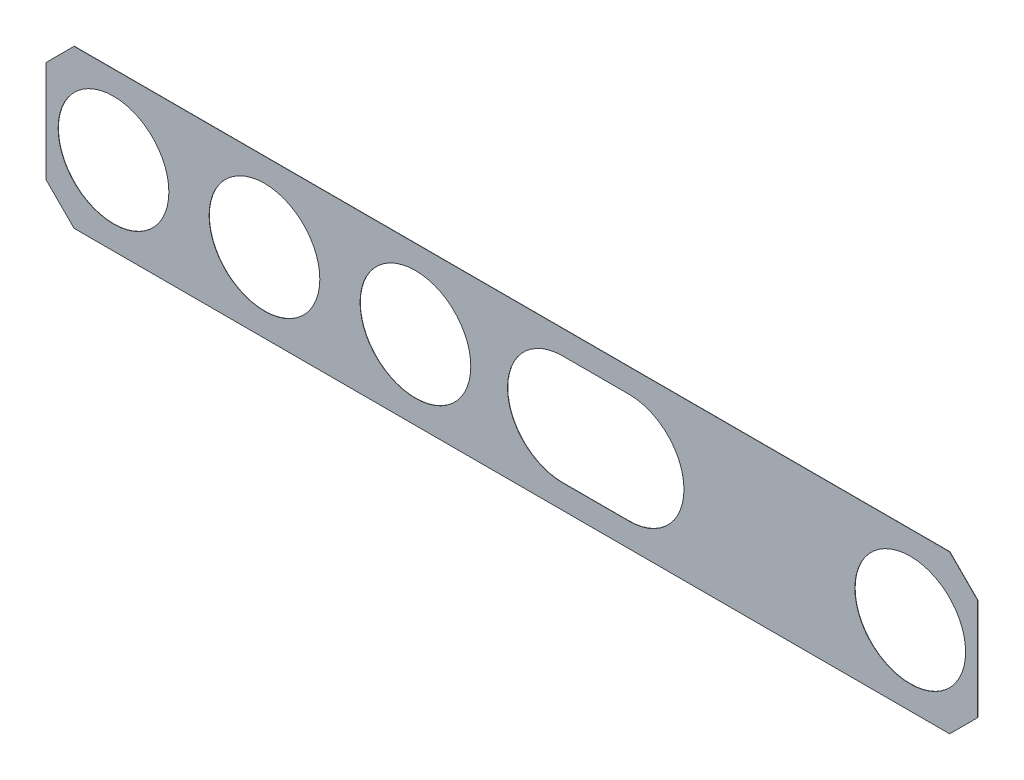
ISO-10303-21;
HEADER;
FILE_DESCRIPTION(('STEP AP214'),'2;1');
FILE_NAME('part.step','',(''),(''),'','','');
FILE_SCHEMA(('AUTOMOTIVE_DESIGN { 1 0 10303 214 1 1 1 1 }'));
ENDSEC;
DATA;
#1=APPLICATION_CONTEXT('core data for automotive mechanical design processes');
#2=APPLICATION_PROTOCOL_DEFINITION('international standard','automotive_design',2000,#1);
#3=PRODUCT_CONTEXT('',#1,'mechanical');
#4=PRODUCT('Part','Part','',(#3));
#5=PRODUCT_RELATED_PRODUCT_CATEGORY('part','',(#4));
#6=PRODUCT_DEFINITION_FORMATION('','',#4);
#7=PRODUCT_DEFINITION_CONTEXT('part definition',#1,'design');
#8=PRODUCT_DEFINITION('design','',#6,#7);
#9=PRODUCT_DEFINITION_SHAPE('','',#8);
#10=(LENGTH_UNIT() NAMED_UNIT(*) SI_UNIT(.MILLI.,.METRE.));
#11=(NAMED_UNIT(*) PLANE_ANGLE_UNIT() SI_UNIT($,.RADIAN.));
#12=(NAMED_UNIT(*) SI_UNIT($,.STERADIAN.) SOLID_ANGLE_UNIT());
#13=UNCERTAINTY_MEASURE_WITH_UNIT(LENGTH_MEASURE(1.E-05),#10,'distance_accuracy_value','');
#14=(GEOMETRIC_REPRESENTATION_CONTEXT(3) GLOBAL_UNCERTAINTY_ASSIGNED_CONTEXT((#13)) GLOBAL_UNIT_ASSIGNED_CONTEXT((#10,
#11,#12)) REPRESENTATION_CONTEXT('',''));
#15=CARTESIAN_POINT('',(0.,0.,0.));
#16=DIRECTION('',(0.,0.,1.));
#17=DIRECTION('',(1.,0.,0.));
#18=AXIS2_PLACEMENT_3D('',#15,#16,#17);
#19=CARTESIAN_POINT('',(13.96785551477,0.,-0.485));
#20=DIRECTION('',(0.,0.,1.));
#21=DIRECTION('',(1.,0.,0.));
#22=AXIS2_PLACEMENT_3D('',#19,#20,#21);
#23=CYLINDRICAL_SURFACE('',#22,6.55);
#24=DIRECTION('',(0.,0.,1.));
#25=VECTOR('',#24,1.);
#26=CARTESIAN_POINT('',(13.96785551477,6.55,-0.515));
#27=LINE('',#26,#25);
#28=CARTESIAN_POINT('',(13.96785551477,6.55,-0.515));
#29=VERTEX_POINT('',#28);
#30=CARTESIAN_POINT('',(13.96785551477,6.55,-0.485));
#31=VERTEX_POINT('',#30);
#32=EDGE_CURVE('E11',#29,#31,#27,.T.);
#33=ORIENTED_EDGE('',*,*,#32,.F.);
#34=CARTESIAN_POINT('',(13.96785551477,0.,-0.515));
#35=DIRECTION('',(0.,0.,-1.));
#36=DIRECTION('',(0.,1.,0.));
#37=AXIS2_PLACEMENT_3D('',#34,#35,#36);
#38=CIRCLE('',#37,6.55);
#39=CARTESIAN_POINT('',(20.51785551477,0.,-0.515));
#40=VERTEX_POINT('',#39);
#41=EDGE_CURVE('E354',#29,#40,#38,.T.);
#42=ORIENTED_EDGE('',*,*,#41,.T.);
#43=CARTESIAN_POINT('',(13.96785551477,0.,-0.515));
#44=DIRECTION('',(0.,0.,-1.));
#45=DIRECTION('',(1.,0.,0.));
#46=AXIS2_PLACEMENT_3D('',#43,#44,#45);
#47=CIRCLE('',#46,6.55);
#48=CARTESIAN_POINT('',(13.96785551477,-6.55,-0.515));
#49=VERTEX_POINT('',#48);
#50=EDGE_CURVE('E351',#40,#49,#47,.T.);
#51=ORIENTED_EDGE('',*,*,#50,.T.);
#52=DIRECTION('',(0.,0.,-1.));
#53=VECTOR('',#52,1.);
#54=CARTESIAN_POINT('',(13.96785551477,-6.55,-0.485));
#55=LINE('',#54,#53);
#56=CARTESIAN_POINT('',(13.96785551477,-6.55,-0.485));
#57=VERTEX_POINT('',#56);
#58=EDGE_CURVE('E205',#57,#49,#55,.T.);
#59=ORIENTED_EDGE('',*,*,#58,.F.);
#60=CARTESIAN_POINT('',(13.96785551477,0.,-0.485));
#61=DIRECTION('',(0.,0.,1.));
#62=DIRECTION('',(0.,-1.,0.));
#63=AXIS2_PLACEMENT_3D('',#60,#61,#62);
#64=CIRCLE('',#63,6.55);
#65=CARTESIAN_POINT('',(20.51785551477,0.,-0.485));
#66=VERTEX_POINT('',#65);
#67=EDGE_CURVE('E200',#57,#66,#64,.T.);
#68=ORIENTED_EDGE('',*,*,#67,.T.);
#69=CARTESIAN_POINT('',(13.96785551477,0.,-0.485));
#70=DIRECTION('',(0.,0.,1.));
#71=DIRECTION('',(1.,0.,0.));
#72=AXIS2_PLACEMENT_3D('',#69,#70,#71);
#73=CIRCLE('',#72,6.55);
#74=EDGE_CURVE('E202',#66,#31,#73,.T.);
#75=ORIENTED_EDGE('',*,*,#74,.T.);
#76=EDGE_LOOP('',(#33,#42,#51,#59,#68,#75));
#77=FACE_BOUND('',#76,.T.);
#78=ADVANCED_FACE('F17',(#77),#23,.F.);
#79=CARTESIAN_POINT('',(6.032144485231,6.55,-0.485));
#80=DIRECTION('',(0.,-1.,0.));
#81=DIRECTION('',(0.,0.,-1.));
#82=AXIS2_PLACEMENT_3D('',#79,#80,#81);
#83=PLANE('',#82);
#84=DIRECTION('',(0.,0.,-1.));
#85=VECTOR('',#84,1.);
#86=CARTESIAN_POINT('',(6.032144485231,6.55,-0.485));
#87=LINE('',#86,#85);
#88=CARTESIAN_POINT('',(6.032144485231,6.55,-0.485));
#89=VERTEX_POINT('',#88);
#90=CARTESIAN_POINT('',(6.032144485231,6.55,-0.515));
#91=VERTEX_POINT('',#90);
#92=EDGE_CURVE('E28',#89,#91,#87,.T.);
#93=ORIENTED_EDGE('',*,*,#92,.T.);
#94=DIRECTION('',(-1.,0.,0.));
#95=VECTOR('',#94,1.);
#96=CARTESIAN_POINT('',(13.96785551477,6.55,-0.515));
#97=LINE('',#96,#95);
#98=EDGE_CURVE('E418',#29,#91,#97,.T.);
#99=ORIENTED_EDGE('',*,*,#98,.F.);
#100=ORIENTED_EDGE('',*,*,#32,.T.);
#101=DIRECTION('',(-1.,0.,0.));
#102=VECTOR('',#101,1.);
#103=CARTESIAN_POINT('',(13.96785551477,6.55,-0.485));
#104=LINE('',#103,#102);
#105=EDGE_CURVE('E216',#31,#89,#104,.T.);
#106=ORIENTED_EDGE('',*,*,#105,.T.);
#107=EDGE_LOOP('',(#93,#99,#100,#106));
#108=FACE_BOUND('',#107,.T.);
#109=ADVANCED_FACE('F433',(#108),#83,.T.);
#110=CARTESIAN_POINT('',(6.032144485231,0.,-0.485));
#111=DIRECTION('',(0.,0.,1.));
#112=DIRECTION('',(1.,0.,0.));
#113=AXIS2_PLACEMENT_3D('',#110,#111,#112);
#114=CYLINDRICAL_SURFACE('',#113,6.55);
#115=DIRECTION('',(0.,0.,1.));
#116=VECTOR('',#115,1.);
#117=CARTESIAN_POINT('',(6.032144485231,-6.55,-0.515));
#118=LINE('',#117,#116);
#119=CARTESIAN_POINT('',(6.032144485231,-6.55,-0.515));
#120=VERTEX_POINT('',#119);
#121=CARTESIAN_POINT('',(6.032144485231,-6.55,-0.485));
#122=VERTEX_POINT('',#121);
#123=EDGE_CURVE('E42',#120,#122,#118,.T.);
#124=ORIENTED_EDGE('',*,*,#123,.F.);
#125=CARTESIAN_POINT('',(6.032144485231,0.,-0.515));
#126=DIRECTION('',(0.,0.,-1.));
#127=DIRECTION('',(0.,-1.,0.));
#128=AXIS2_PLACEMENT_3D('',#125,#126,#127);
#129=CIRCLE('',#128,6.55);
#130=CARTESIAN_POINT('',(-0.517855514769,0.,-0.515));
#131=VERTEX_POINT('',#130);
#132=EDGE_CURVE('E257',#120,#131,#129,.T.);
#133=ORIENTED_EDGE('',*,*,#132,.T.);
#134=CARTESIAN_POINT('',(6.032144485231,0.,-0.515));
#135=DIRECTION('',(0.,0.,-1.));
#136=DIRECTION('',(-1.,0.,0.));
#137=AXIS2_PLACEMENT_3D('',#134,#135,#136);
#138=CIRCLE('',#137,6.55);
#139=EDGE_CURVE('E260',#131,#91,#138,.T.);
#140=ORIENTED_EDGE('',*,*,#139,.T.);
#141=ORIENTED_EDGE('',*,*,#92,.F.);
#142=CARTESIAN_POINT('',(6.032144485231,0.,-0.485));
#143=DIRECTION('',(0.,0.,1.));
#144=DIRECTION('',(0.,1.,0.));
#145=AXIS2_PLACEMENT_3D('',#142,#143,#144);
#146=CIRCLE('',#145,6.55);
#147=CARTESIAN_POINT('',(-0.517855514769,0.,-0.485));
#148=VERTEX_POINT('',#147);
#149=EDGE_CURVE('E223',#89,#148,#146,.T.);
#150=ORIENTED_EDGE('',*,*,#149,.T.);
#151=CARTESIAN_POINT('',(6.032144485231,0.,-0.485));
#152=DIRECTION('',(0.,0.,1.));
#153=DIRECTION('',(-1.,0.,0.));
#154=AXIS2_PLACEMENT_3D('',#151,#152,#153);
#155=CIRCLE('',#154,6.55);
#156=EDGE_CURVE('E237',#148,#122,#155,.T.);
#157=ORIENTED_EDGE('',*,*,#156,.T.);
#158=EDGE_LOOP('',(#124,#133,#140,#141,#150,#157));
#159=FACE_BOUND('',#158,.T.);
#160=ADVANCED_FACE('F425',(#159),#114,.F.);
#161=CARTESIAN_POINT('',(13.96785551477,-6.55,-0.485));
#162=DIRECTION('',(0.,1.,0.));
#163=DIRECTION('',(1.,0.,0.));
#164=AXIS2_PLACEMENT_3D('',#161,#162,#163);
#165=PLANE('',#164);
#166=ORIENTED_EDGE('',*,*,#58,.T.);
#167=DIRECTION('',(1.,0.,0.));
#168=VECTOR('',#167,1.);
#169=CARTESIAN_POINT('',(6.032144485231,-6.55,-0.515));
#170=LINE('',#169,#168);
#171=EDGE_CURVE('E227',#120,#49,#170,.T.);
#172=ORIENTED_EDGE('',*,*,#171,.F.);
#173=ORIENTED_EDGE('',*,*,#123,.T.);
#174=DIRECTION('',(1.,0.,0.));
#175=VECTOR('',#174,1.);
#176=CARTESIAN_POINT('',(6.032144485231,-6.55,-0.485));
#177=LINE('',#176,#175);
#178=EDGE_CURVE('E210',#122,#57,#177,.T.);
#179=ORIENTED_EDGE('',*,*,#178,.T.);
#180=EDGE_LOOP('',(#166,#172,#173,#179));
#181=FACE_BOUND('',#180,.T.);
#182=ADVANCED_FACE('F435',(#181),#165,.T.);
#183=CARTESIAN_POINT('',(47.5,0.,-0.485));
#184=DIRECTION('',(0.,0.,1.));
#185=DIRECTION('',(1.,0.,0.));
#186=AXIS2_PLACEMENT_3D('',#183,#184,#185);
#187=CYLINDRICAL_SURFACE('',#186,6.6);
#188=DIRECTION('',(0.,0.,1.));
#189=VECTOR('',#188,1.);
#190=CARTESIAN_POINT('',(54.1,0.,-0.515));
#191=LINE('',#190,#189);
#192=CARTESIAN_POINT('',(54.1,0.,-0.515));
#193=VERTEX_POINT('',#192);
#194=CARTESIAN_POINT('',(54.1,0.,-0.485));
#195=VERTEX_POINT('',#194);
#196=EDGE_CURVE('E261',#193,#195,#191,.T.);
#197=ORIENTED_EDGE('',*,*,#196,.F.);
#198=CARTESIAN_POINT('',(47.5,0.,-0.515));
#199=DIRECTION('',(0.,0.,-1.));
#200=DIRECTION('',(1.,0.,0.));
#201=AXIS2_PLACEMENT_3D('',#198,#199,#200);
#202=CIRCLE('',#201,6.6);
#203=CARTESIAN_POINT('',(40.9,0.,-0.515));
#204=VERTEX_POINT('',#203);
#205=EDGE_CURVE('E338',#193,#204,#202,.T.);
#206=ORIENTED_EDGE('',*,*,#205,.T.);
#207=DIRECTION('',(0.,0.,1.));
#208=VECTOR('',#207,1.);
#209=CARTESIAN_POINT('',(40.9,0.,-0.515));
#210=LINE('',#209,#208);
#211=CARTESIAN_POINT('',(40.9,0.,-0.485));
#212=VERTEX_POINT('',#211);
#213=EDGE_CURVE('E265',#204,#212,#210,.T.);
#214=ORIENTED_EDGE('',*,*,#213,.T.);
#215=CARTESIAN_POINT('',(47.5,0.,-0.485));
#216=DIRECTION('',(0.,0.,1.));
#217=DIRECTION('',(-1.,0.,0.));
#218=AXIS2_PLACEMENT_3D('',#215,#216,#217);
#219=CIRCLE('',#218,6.6);
#220=EDGE_CURVE('E238',#212,#195,#219,.T.);
#221=ORIENTED_EDGE('',*,*,#220,.T.);
#222=EDGE_LOOP('',(#197,#206,#214,#221));
#223=FACE_BOUND('',#222,.T.);
#224=ADVANCED_FACE('F19',(#223),#187,.F.);
#225=CARTESIAN_POINT('',(47.5,0.,-0.485));
#226=DIRECTION('',(0.,0.,1.));
#227=DIRECTION('',(1.,0.,0.));
#228=AXIS2_PLACEMENT_3D('',#225,#226,#227);
#229=CYLINDRICAL_SURFACE('',#228,6.6);
#230=ORIENTED_EDGE('',*,*,#213,.F.);
#231=CARTESIAN_POINT('',(47.5,0.,-0.515));
#232=DIRECTION('',(0.,0.,-1.));
#233=DIRECTION('',(-1.,0.,0.));
#234=AXIS2_PLACEMENT_3D('',#231,#232,#233);
#235=CIRCLE('',#234,6.6);
#236=EDGE_CURVE('E355',#204,#193,#235,.T.);
#237=ORIENTED_EDGE('',*,*,#236,.T.);
#238=ORIENTED_EDGE('',*,*,#196,.T.);
#239=CARTESIAN_POINT('',(47.5,0.,-0.485));
#240=DIRECTION('',(0.,0.,1.));
#241=DIRECTION('',(1.,0.,0.));
#242=AXIS2_PLACEMENT_3D('',#239,#240,#241);
#243=CIRCLE('',#242,6.6);
#244=EDGE_CURVE('E233',#195,#212,#243,.T.);
#245=ORIENTED_EDGE('',*,*,#244,.T.);
#246=EDGE_LOOP('',(#230,#237,#238,#245));
#247=FACE_BOUND('',#246,.T.);
#248=ADVANCED_FACE('F495',(#247),#229,.F.);
#249=CARTESIAN_POINT('',(-47.5,0.,-0.485));
#250=DIRECTION('',(0.,0.,1.));
#251=DIRECTION('',(1.,0.,0.));
#252=AXIS2_PLACEMENT_3D('',#249,#250,#251);
#253=CYLINDRICAL_SURFACE('',#252,6.6);
#254=DIRECTION('',(0.,0.,1.));
#255=VECTOR('',#254,1.);
#256=CARTESIAN_POINT('',(-54.1,0.,-0.515));
#257=LINE('',#256,#255);
#258=CARTESIAN_POINT('',(-54.1,0.,-0.515));
#259=VERTEX_POINT('',#258);
#260=CARTESIAN_POINT('',(-54.1,0.,-0.485));
#261=VERTEX_POINT('',#260);
#262=EDGE_CURVE('E378',#259,#261,#257,.T.);
#263=ORIENTED_EDGE('',*,*,#262,.F.);
#264=CARTESIAN_POINT('',(-47.5,0.,-0.515));
#265=DIRECTION('',(0.,0.,-1.));
#266=DIRECTION('',(-1.,0.,0.));
#267=AXIS2_PLACEMENT_3D('',#264,#265,#266);
#268=CIRCLE('',#267,6.6);
#269=CARTESIAN_POINT('',(-40.9,0.,-0.515));
#270=VERTEX_POINT('',#269);
#271=EDGE_CURVE('E339',#259,#270,#268,.T.);
#272=ORIENTED_EDGE('',*,*,#271,.T.);
#273=DIRECTION('',(0.,0.,1.));
#274=VECTOR('',#273,1.);
#275=CARTESIAN_POINT('',(-40.9,0.,-0.515));
#276=LINE('',#275,#274);
#277=CARTESIAN_POINT('',(-40.9,0.,-0.485));
#278=VERTEX_POINT('',#277);
#279=EDGE_CURVE('E375',#270,#278,#276,.T.);
#280=ORIENTED_EDGE('',*,*,#279,.T.);
#281=CARTESIAN_POINT('',(-47.5,0.,-0.485));
#282=DIRECTION('',(0.,0.,1.));
#283=DIRECTION('',(1.,0.,0.));
#284=AXIS2_PLACEMENT_3D('',#281,#282,#283);
#285=CIRCLE('',#284,6.6);
#286=EDGE_CURVE('E311',#278,#261,#285,.T.);
#287=ORIENTED_EDGE('',*,*,#286,.T.);
#288=EDGE_LOOP('',(#263,#272,#280,#287));
#289=FACE_BOUND('',#288,.T.);
#290=ADVANCED_FACE('F500',(#289),#253,.F.);
#291=CARTESIAN_POINT('',(-47.5,0.,-0.485));
#292=DIRECTION('',(0.,0.,1.));
#293=DIRECTION('',(1.,0.,0.));
#294=AXIS2_PLACEMENT_3D('',#291,#292,#293);
#295=CYLINDRICAL_SURFACE('',#294,6.6);
#296=ORIENTED_EDGE('',*,*,#279,.F.);
#297=CARTESIAN_POINT('',(-47.5,0.,-0.515));
#298=DIRECTION('',(0.,0.,-1.));
#299=DIRECTION('',(1.,0.,0.));
#300=AXIS2_PLACEMENT_3D('',#297,#298,#299);
#301=CIRCLE('',#300,6.6);
#302=EDGE_CURVE('E334',#270,#259,#301,.T.);
#303=ORIENTED_EDGE('',*,*,#302,.T.);
#304=ORIENTED_EDGE('',*,*,#262,.T.);
#305=CARTESIAN_POINT('',(-47.5,0.,-0.485));
#306=DIRECTION('',(0.,0.,1.));
#307=DIRECTION('',(-1.,0.,0.));
#308=AXIS2_PLACEMENT_3D('',#305,#306,#307);
#309=CIRCLE('',#308,6.6);
#310=EDGE_CURVE('E308',#261,#278,#309,.T.);
#311=ORIENTED_EDGE('',*,*,#310,.T.);
#312=EDGE_LOOP('',(#296,#303,#304,#311));
#313=FACE_BOUND('',#312,.T.);
#314=ADVANCED_FACE('F510',(#313),#295,.F.);
#315=CARTESIAN_POINT('',(-29.5,0.,-0.485));
#316=DIRECTION('',(0.,0.,1.));
#317=DIRECTION('',(1.,0.,0.));
#318=AXIS2_PLACEMENT_3D('',#315,#316,#317);
#319=CYLINDRICAL_SURFACE('',#318,6.6);
#320=DIRECTION('',(0.,0.,1.));
#321=VECTOR('',#320,1.);
#322=CARTESIAN_POINT('',(-36.1,0.,-0.515));
#323=LINE('',#322,#321);
#324=CARTESIAN_POINT('',(-36.1,0.,-0.515));
#325=VERTEX_POINT('',#324);
#326=CARTESIAN_POINT('',(-36.1,0.,-0.485));
#327=VERTEX_POINT('',#326);
#328=EDGE_CURVE('E343',#325,#327,#323,.T.);
#329=ORIENTED_EDGE('',*,*,#328,.F.);
#330=CARTESIAN_POINT('',(-29.5,0.,-0.515));
#331=DIRECTION('',(0.,0.,-1.));
#332=DIRECTION('',(-1.,0.,0.));
#333=AXIS2_PLACEMENT_3D('',#330,#331,#332);
#334=CIRCLE('',#333,6.6);
#335=CARTESIAN_POINT('',(-22.9,0.,-0.515));
#336=VERTEX_POINT('',#335);
#337=EDGE_CURVE('E331',#325,#336,#334,.T.);
#338=ORIENTED_EDGE('',*,*,#337,.T.);
#339=DIRECTION('',(0.,0.,1.));
#340=VECTOR('',#339,1.);
#341=CARTESIAN_POINT('',(-22.9,0.,-0.515));
#342=LINE('',#341,#340);
#343=CARTESIAN_POINT('',(-22.9,0.,-0.485));
#344=VERTEX_POINT('',#343);
#345=EDGE_CURVE('E340',#336,#344,#342,.T.);
#346=ORIENTED_EDGE('',*,*,#345,.T.);
#347=CARTESIAN_POINT('',(-29.5,0.,-0.485));
#348=DIRECTION('',(0.,0.,1.));
#349=DIRECTION('',(1.,0.,0.));
#350=AXIS2_PLACEMENT_3D('',#347,#348,#349);
#351=CIRCLE('',#350,6.6);
#352=EDGE_CURVE('E328',#344,#327,#351,.T.);
#353=ORIENTED_EDGE('',*,*,#352,.T.);
#354=EDGE_LOOP('',(#329,#338,#346,#353));
#355=FACE_BOUND('',#354,.T.);
#356=ADVANCED_FACE('F568',(#355),#319,.F.);
#357=CARTESIAN_POINT('',(-29.5,0.,-0.485));
#358=DIRECTION('',(0.,0.,1.));
#359=DIRECTION('',(1.,0.,0.));
#360=AXIS2_PLACEMENT_3D('',#357,#358,#359);
#361=CYLINDRICAL_SURFACE('',#360,6.6);
#362=ORIENTED_EDGE('',*,*,#345,.F.);
#363=CARTESIAN_POINT('',(-29.5,0.,-0.515));
#364=DIRECTION('',(0.,0.,-1.));
#365=DIRECTION('',(1.,0.,0.));
#366=AXIS2_PLACEMENT_3D('',#363,#364,#365);
#367=CIRCLE('',#366,6.6);
#368=EDGE_CURVE('E371',#336,#325,#367,.T.);
#369=ORIENTED_EDGE('',*,*,#368,.T.);
#370=ORIENTED_EDGE('',*,*,#328,.T.);
#371=CARTESIAN_POINT('',(-29.5,0.,-0.485));
#372=DIRECTION('',(0.,0.,1.));
#373=DIRECTION('',(-1.,0.,0.));
#374=AXIS2_PLACEMENT_3D('',#371,#372,#373);
#375=CIRCLE('',#374,6.6);
#376=EDGE_CURVE('E321',#327,#344,#375,.T.);
#377=ORIENTED_EDGE('',*,*,#376,.T.);
#378=EDGE_LOOP('',(#362,#369,#370,#377));
#379=FACE_BOUND('',#378,.T.);
#380=ADVANCED_FACE('F535',(#379),#361,.F.);
#381=CARTESIAN_POINT('',(-11.5,0.,-0.485));
#382=DIRECTION('',(0.,0.,1.));
#383=DIRECTION('',(1.,0.,0.));
#384=AXIS2_PLACEMENT_3D('',#381,#382,#383);
#385=CYLINDRICAL_SURFACE('',#384,6.6);
#386=DIRECTION('',(0.,0.,1.));
#387=VECTOR('',#386,1.);
#388=CARTESIAN_POINT('',(-18.1,0.,-0.515));
#389=LINE('',#388,#387);
#390=CARTESIAN_POINT('',(-18.1,0.,-0.515));
#391=VERTEX_POINT('',#390);
#392=CARTESIAN_POINT('',(-18.1,0.,-0.485));
#393=VERTEX_POINT('',#392);
#394=EDGE_CURVE('E82',#391,#393,#389,.T.);
#395=ORIENTED_EDGE('',*,*,#394,.F.);
#396=CARTESIAN_POINT('',(-11.5,0.,-0.515));
#397=DIRECTION('',(0.,0.,-1.));
#398=DIRECTION('',(-1.,0.,0.));
#399=AXIS2_PLACEMENT_3D('',#396,#397,#398);
#400=CIRCLE('',#399,6.6);
#401=CARTESIAN_POINT('',(-4.9,0.,-0.515));
#402=VERTEX_POINT('',#401);
#403=EDGE_CURVE('E370',#391,#402,#400,.T.);
#404=ORIENTED_EDGE('',*,*,#403,.T.);
#405=DIRECTION('',(0.,0.,1.));
#406=VECTOR('',#405,1.);
#407=CARTESIAN_POINT('',(-4.9,0.,-0.515));
#408=LINE('',#407,#406);
#409=CARTESIAN_POINT('',(-4.9,0.,-0.485));
#410=VERTEX_POINT('',#409);
#411=EDGE_CURVE('E239',#402,#410,#408,.T.);
#412=ORIENTED_EDGE('',*,*,#411,.T.);
#413=CARTESIAN_POINT('',(-11.5,0.,-0.485));
#414=DIRECTION('',(0.,0.,1.));
#415=DIRECTION('',(1.,0.,0.));
#416=AXIS2_PLACEMENT_3D('',#413,#414,#415);
#417=CIRCLE('',#416,6.6);
#418=EDGE_CURVE('E270',#410,#393,#417,.T.);
#419=ORIENTED_EDGE('',*,*,#418,.T.);
#420=EDGE_LOOP('',(#395,#404,#412,#419));
#421=FACE_BOUND('',#420,.T.);
#422=ADVANCED_FACE('F531',(#421),#385,.F.);
#423=CARTESIAN_POINT('',(-11.5,0.,-0.485));
#424=DIRECTION('',(0.,0.,1.));
#425=DIRECTION('',(1.,0.,0.));
#426=AXIS2_PLACEMENT_3D('',#423,#424,#425);
#427=CYLINDRICAL_SURFACE('',#426,6.6);
#428=ORIENTED_EDGE('',*,*,#411,.F.);
#429=CARTESIAN_POINT('',(-11.5,0.,-0.515));
#430=DIRECTION('',(0.,0.,-1.));
#431=DIRECTION('',(1.,0.,0.));
#432=AXIS2_PLACEMENT_3D('',#429,#430,#431);
#433=CIRCLE('',#432,6.6);
#434=EDGE_CURVE('E367',#402,#391,#433,.T.);
#435=ORIENTED_EDGE('',*,*,#434,.T.);
#436=ORIENTED_EDGE('',*,*,#394,.T.);
#437=CARTESIAN_POINT('',(-11.5,0.,-0.485));
#438=DIRECTION('',(0.,0.,1.));
#439=DIRECTION('',(-1.,0.,0.));
#440=AXIS2_PLACEMENT_3D('',#437,#438,#439);
#441=CIRCLE('',#440,6.6);
#442=EDGE_CURVE('E361',#393,#410,#441,.T.);
#443=ORIENTED_EDGE('',*,*,#442,.T.);
#444=EDGE_LOOP('',(#428,#435,#436,#443));
#445=FACE_BOUND('',#444,.T.);
#446=ADVANCED_FACE('F526',(#445),#427,.F.);
#447=CARTESIAN_POINT('',(0.,0.,-0.515));
#448=DIRECTION('',(0.,0.,1.));
#449=DIRECTION('',(1.,0.,0.));
#450=AXIS2_PLACEMENT_3D('',#447,#448,#449);
#451=PLANE('',#450);
#452=ORIENTED_EDGE('',*,*,#50,.F.);
#453=ORIENTED_EDGE('',*,*,#41,.F.);
#454=ORIENTED_EDGE('',*,*,#98,.T.);
#455=ORIENTED_EDGE('',*,*,#139,.F.);
#456=ORIENTED_EDGE('',*,*,#132,.F.);
#457=ORIENTED_EDGE('',*,*,#171,.T.);
#458=EDGE_LOOP('',(#452,#453,#454,#455,#456,#457));
#459=FACE_BOUND('',#458,.T.);
#460=ORIENTED_EDGE('',*,*,#205,.F.);
#461=ORIENTED_EDGE('',*,*,#236,.F.);
#462=EDGE_LOOP('',(#460,#461));
#463=FACE_BOUND('',#462,.T.);
#464=ORIENTED_EDGE('',*,*,#271,.F.);
#465=ORIENTED_EDGE('',*,*,#302,.F.);
#466=EDGE_LOOP('',(#464,#465));
#467=FACE_BOUND('',#466,.T.);
#468=ORIENTED_EDGE('',*,*,#337,.F.);
#469=ORIENTED_EDGE('',*,*,#368,.F.);
#470=EDGE_LOOP('',(#468,#469));
#471=FACE_BOUND('',#470,.T.);
#472=ORIENTED_EDGE('',*,*,#403,.F.);
#473=ORIENTED_EDGE('',*,*,#434,.F.);
#474=EDGE_LOOP('',(#472,#473));
#475=FACE_BOUND('',#474,.T.);
#476=DIRECTION('',(0.,-1.,0.));
#477=VECTOR('',#476,1.);
#478=CARTESIAN_POINT('',(55.55,6.050050506339,-0.515));
#479=LINE('',#478,#477);
#480=CARTESIAN_POINT('',(55.55,6.050050506339,-0.515));
#481=VERTEX_POINT('',#480);
#482=CARTESIAN_POINT('',(55.55,-6.05005050634,-0.515));
#483=VERTEX_POINT('',#482);
#484=EDGE_CURVE('E69',#481,#483,#479,.T.);
#485=ORIENTED_EDGE('',*,*,#484,.T.);
#486=DIRECTION('',(0.707106781186498,0.707106781186597,0.));
#487=VECTOR('',#486,1.);
#488=CARTESIAN_POINT('',(52.20005050634,-9.4,-0.515));
#489=LINE('',#488,#487);
#490=CARTESIAN_POINT('',(52.20005050634,-9.4,-0.515));
#491=VERTEX_POINT('',#490);
#492=EDGE_CURVE('E62',#491,#483,#489,.T.);
#493=ORIENTED_EDGE('',*,*,#492,.F.);
#494=DIRECTION('',(-1.,0.,0.));
#495=VECTOR('',#494,1.);
#496=CARTESIAN_POINT('',(52.20005050634,-9.4,-0.515));
#497=LINE('',#496,#495);
#498=CARTESIAN_POINT('',(-52.20005050634,-9.4,-0.515));
#499=VERTEX_POINT('',#498);
#500=EDGE_CURVE('E272',#491,#499,#497,.T.);
#501=ORIENTED_EDGE('',*,*,#500,.T.);
#502=DIRECTION('',(0.707106781186498,-0.707106781186597,0.));
#503=VECTOR('',#502,1.);
#504=CARTESIAN_POINT('',(-55.55,-6.050050506339,-0.515));
#505=LINE('',#504,#503);
#506=CARTESIAN_POINT('',(-55.55,-6.050050506339,-0.515));
#507=VERTEX_POINT('',#506);
#508=EDGE_CURVE('E399',#507,#499,#505,.T.);
#509=ORIENTED_EDGE('',*,*,#508,.F.);
#510=DIRECTION('',(0.,1.,0.));
#511=VECTOR('',#510,1.);
#512=CARTESIAN_POINT('',(-55.55,-6.050050506339,-0.515));
#513=LINE('',#512,#511);
#514=CARTESIAN_POINT('',(-55.55,6.05005050634,-0.515));
#515=VERTEX_POINT('',#514);
#516=EDGE_CURVE('E346',#507,#515,#513,.T.);
#517=ORIENTED_EDGE('',*,*,#516,.T.);
#518=DIRECTION('',(-0.707106781186498,-0.707106781186597,0.));
#519=VECTOR('',#518,1.);
#520=CARTESIAN_POINT('',(-52.20005050634,9.4,-0.515));
#521=LINE('',#520,#519);
#522=CARTESIAN_POINT('',(-52.20005050634,9.4,-0.515));
#523=VERTEX_POINT('',#522);
#524=EDGE_CURVE('E231',#523,#515,#521,.T.);
#525=ORIENTED_EDGE('',*,*,#524,.F.);
#526=DIRECTION('',(1.,0.,0.));
#527=VECTOR('',#526,1.);
#528=CARTESIAN_POINT('',(-52.20005050634,9.4,-0.515));
#529=LINE('',#528,#527);
#530=CARTESIAN_POINT('',(52.20005050634,9.4,-0.515));
#531=VERTEX_POINT('',#530);
#532=EDGE_CURVE('E21',#523,#531,#529,.T.);
#533=ORIENTED_EDGE('',*,*,#532,.T.);
#534=DIRECTION('',(-0.707106781186498,0.707106781186597,0.));
#535=VECTOR('',#534,1.);
#536=CARTESIAN_POINT('',(55.55,6.050050506339,-0.515));
#537=LINE('',#536,#535);
#538=EDGE_CURVE('E284',#481,#531,#537,.T.);
#539=ORIENTED_EDGE('',*,*,#538,.F.);
#540=EDGE_LOOP('',(#485,#493,#501,#509,#517,#525,#533,#539));
#541=FACE_BOUND('',#540,.T.);
#542=ADVANCED_FACE('F430',(#459,#463,#467,#471,#475,#541),#451,.F.);
#543=CARTESIAN_POINT('',(55.55,-6.050050506339,-0.485));
#544=DIRECTION('',(1.,0.,0.));
#545=DIRECTION('',(0.,1.,0.));
#546=AXIS2_PLACEMENT_3D('',#543,#544,#545);
#547=PLANE('',#546);
#548=DIRECTION('',(0.,0.,1.));
#549=VECTOR('',#548,1.);
#550=CARTESIAN_POINT('',(55.55,-6.050050506339,-0.515));
#551=LINE('',#550,#549);
#552=CARTESIAN_POINT('',(55.55,-6.05005050634,-0.485));
#553=VERTEX_POINT('',#552);
#554=EDGE_CURVE('E305',#483,#553,#551,.T.);
#555=ORIENTED_EDGE('',*,*,#554,.F.);
#556=ORIENTED_EDGE('',*,*,#484,.F.);
#557=DIRECTION('',(0.,0.,1.));
#558=VECTOR('',#557,1.);
#559=CARTESIAN_POINT('',(55.55,6.050050506339,-0.515));
#560=LINE('',#559,#558);
#561=CARTESIAN_POINT('',(55.55,6.050050506339,-0.485));
#562=VERTEX_POINT('',#561);
#563=EDGE_CURVE('E383',#481,#562,#560,.T.);
#564=ORIENTED_EDGE('',*,*,#563,.T.);
#565=DIRECTION('',(0.,-1.,0.));
#566=VECTOR('',#565,1.);
#567=CARTESIAN_POINT('',(55.55,6.050050506339,-0.485));
#568=LINE('',#567,#566);
#569=EDGE_CURVE('E271',#562,#553,#568,.T.);
#570=ORIENTED_EDGE('',*,*,#569,.T.);
#571=EDGE_LOOP('',(#555,#556,#564,#570));
#572=FACE_BOUND('',#571,.T.);
#573=ADVANCED_FACE('F525',(#572),#547,.T.);
#574=CARTESIAN_POINT('',(52.20005050634,-9.4,-0.485));
#575=DIRECTION('',(0.707106781186548,-0.707106781186548,0.));
#576=DIRECTION('',(0.,0.,-1.));
#577=AXIS2_PLACEMENT_3D('',#574,#575,#576);
#578=PLANE('',#577);
#579=DIRECTION('',(0.,0.,1.));
#580=VECTOR('',#579,1.);
#581=CARTESIAN_POINT('',(52.20005050634,-9.4,-0.515));
#582=LINE('',#581,#580);
#583=CARTESIAN_POINT('',(52.20005050634,-9.4,-0.485));
#584=VERTEX_POINT('',#583);
#585=EDGE_CURVE('E274',#491,#584,#582,.T.);
#586=ORIENTED_EDGE('',*,*,#585,.F.);
#587=ORIENTED_EDGE('',*,*,#492,.T.);
#588=ORIENTED_EDGE('',*,*,#554,.T.);
#589=DIRECTION('',(-0.707106781186498,-0.707106781186597,0.));
#590=VECTOR('',#589,1.);
#591=CARTESIAN_POINT('',(55.55,-6.05005050634,-0.485));
#592=LINE('',#591,#590);
#593=EDGE_CURVE('E277',#553,#584,#592,.T.);
#594=ORIENTED_EDGE('',*,*,#593,.T.);
#595=EDGE_LOOP('',(#586,#587,#588,#594));
#596=FACE_BOUND('',#595,.T.);
#597=ADVANCED_FACE('F555',(#596),#578,.T.);
#598=CARTESIAN_POINT('',(-52.20005050634,-9.4,-0.485));
#599=DIRECTION('',(0.,-1.,0.));
#600=DIRECTION('',(0.,0.,-1.));
#601=AXIS2_PLACEMENT_3D('',#598,#599,#600);
#602=PLANE('',#601);
#603=DIRECTION('',(0.,0.,1.));
#604=VECTOR('',#603,1.);
#605=CARTESIAN_POINT('',(-52.20005050634,-9.4,-0.515));
#606=LINE('',#605,#604);
#607=CARTESIAN_POINT('',(-52.20005050634,-9.4,-0.485));
#608=VERTEX_POINT('',#607);
#609=EDGE_CURVE('E275',#499,#608,#606,.T.);
#610=ORIENTED_EDGE('',*,*,#609,.F.);
#611=ORIENTED_EDGE('',*,*,#500,.F.);
#612=ORIENTED_EDGE('',*,*,#585,.T.);
#613=DIRECTION('',(-1.,0.,0.));
#614=VECTOR('',#613,1.);
#615=CARTESIAN_POINT('',(52.20005050634,-9.4,-0.485));
#616=LINE('',#615,#614);
#617=EDGE_CURVE('E252',#584,#608,#616,.T.);
#618=ORIENTED_EDGE('',*,*,#617,.T.);
#619=EDGE_LOOP('',(#610,#611,#612,#618));
#620=FACE_BOUND('',#619,.T.);
#621=ADVANCED_FACE('F559',(#620),#602,.T.);
#622=CARTESIAN_POINT('',(-55.55,-6.050050506339,-0.485));
#623=DIRECTION('',(-0.707106781186548,-0.707106781186548,0.));
#624=DIRECTION('',(-0.707106781186548,0.707106781186548,0.));
#625=AXIS2_PLACEMENT_3D('',#622,#623,#624);
#626=PLANE('',#625);
#627=DIRECTION('',(0.,0.,1.));
#628=VECTOR('',#627,1.);
#629=CARTESIAN_POINT('',(-55.55,-6.050050506339,-0.515));
#630=LINE('',#629,#628);
#631=CARTESIAN_POINT('',(-55.55,-6.050050506339,-0.485));
#632=VERTEX_POINT('',#631);
#633=EDGE_CURVE('E387',#507,#632,#630,.T.);
#634=ORIENTED_EDGE('',*,*,#633,.F.);
#635=ORIENTED_EDGE('',*,*,#508,.T.);
#636=ORIENTED_EDGE('',*,*,#609,.T.);
#637=DIRECTION('',(-0.707106781186498,0.707106781186597,0.));
#638=VECTOR('',#637,1.);
#639=CARTESIAN_POINT('',(-52.20005050634,-9.4,-0.485));
#640=LINE('',#639,#638);
#641=EDGE_CURVE('E247',#608,#632,#640,.T.);
#642=ORIENTED_EDGE('',*,*,#641,.T.);
#643=EDGE_LOOP('',(#634,#635,#636,#642));
#644=FACE_BOUND('',#643,.T.);
#645=ADVANCED_FACE('F629',(#644),#626,.T.);
#646=CARTESIAN_POINT('',(-55.55,6.050050506339,-0.485));
#647=DIRECTION('',(-1.,0.,0.));
#648=DIRECTION('',(0.,0.,1.));
#649=AXIS2_PLACEMENT_3D('',#646,#647,#648);
#650=PLANE('',#649);
#651=DIRECTION('',(0.,0.,1.));
#652=VECTOR('',#651,1.);
#653=CARTESIAN_POINT('',(-55.55,6.050050506339,-0.515));
#654=LINE('',#653,#652);
#655=CARTESIAN_POINT('',(-55.55,6.05005050634,-0.485));
#656=VERTEX_POINT('',#655);
#657=EDGE_CURVE('E256',#515,#656,#654,.T.);
#658=ORIENTED_EDGE('',*,*,#657,.F.);
#659=ORIENTED_EDGE('',*,*,#516,.F.);
#660=ORIENTED_EDGE('',*,*,#633,.T.);
#661=DIRECTION('',(0.,1.,0.));
#662=VECTOR('',#661,1.);
#663=CARTESIAN_POINT('',(-55.55,-6.050050506339,-0.485));
#664=LINE('',#663,#662);
#665=EDGE_CURVE('E243',#632,#656,#664,.T.);
#666=ORIENTED_EDGE('',*,*,#665,.T.);
#667=EDGE_LOOP('',(#658,#659,#660,#666));
#668=FACE_BOUND('',#667,.T.);
#669=ADVANCED_FACE('F488',(#668),#650,.T.);
#670=CARTESIAN_POINT('',(-52.20005050634,9.4,-0.485));
#671=DIRECTION('',(-0.707106781186548,0.707106781186548,0.));
#672=DIRECTION('',(0.,0.,1.));
#673=AXIS2_PLACEMENT_3D('',#670,#671,#672);
#674=PLANE('',#673);
#675=DIRECTION('',(0.,0.,1.));
#676=VECTOR('',#675,1.);
#677=CARTESIAN_POINT('',(-52.20005050634,9.4,-0.515));
#678=LINE('',#677,#676);
#679=CARTESIAN_POINT('',(-52.20005050634,9.4,-0.485));
#680=VERTEX_POINT('',#679);
#681=EDGE_CURVE('E229',#523,#680,#678,.T.);
#682=ORIENTED_EDGE('',*,*,#681,.F.);
#683=ORIENTED_EDGE('',*,*,#524,.T.);
#684=ORIENTED_EDGE('',*,*,#657,.T.);
#685=DIRECTION('',(0.707106781186498,0.707106781186597,0.));
#686=VECTOR('',#685,1.);
#687=CARTESIAN_POINT('',(-55.55,6.05005050634,-0.485));
#688=LINE('',#687,#686);
#689=EDGE_CURVE('E248',#656,#680,#688,.T.);
#690=ORIENTED_EDGE('',*,*,#689,.T.);
#691=EDGE_LOOP('',(#682,#683,#684,#690));
#692=FACE_BOUND('',#691,.T.);
#693=ADVANCED_FACE('F490',(#692),#674,.T.);
#694=CARTESIAN_POINT('',(52.20005050634,9.4,-0.485));
#695=DIRECTION('',(0.,1.,0.));
#696=DIRECTION('',(1.,0.,0.));
#697=AXIS2_PLACEMENT_3D('',#694,#695,#696);
#698=PLANE('',#697);
#699=DIRECTION('',(0.,0.,1.));
#700=VECTOR('',#699,1.);
#701=CARTESIAN_POINT('',(52.20005050634,9.4,-0.515));
#702=LINE('',#701,#700);
#703=CARTESIAN_POINT('',(52.20005050634,9.4,-0.485));
#704=VERTEX_POINT('',#703);
#705=EDGE_CURVE('E281',#531,#704,#702,.T.);
#706=ORIENTED_EDGE('',*,*,#705,.F.);
#707=ORIENTED_EDGE('',*,*,#532,.F.);
#708=ORIENTED_EDGE('',*,*,#681,.T.);
#709=DIRECTION('',(1.,0.,0.));
#710=VECTOR('',#709,1.);
#711=CARTESIAN_POINT('',(-52.20005050634,9.4,-0.485));
#712=LINE('',#711,#710);
#713=EDGE_CURVE('E288',#680,#704,#712,.T.);
#714=ORIENTED_EDGE('',*,*,#713,.T.);
#715=EDGE_LOOP('',(#706,#707,#708,#714));
#716=FACE_BOUND('',#715,.T.);
#717=ADVANCED_FACE('F492',(#716),#698,.T.);
#718=CARTESIAN_POINT('',(55.55,6.050050506339,-0.485));
#719=DIRECTION('',(0.707106781186548,0.707106781186548,0.));
#720=DIRECTION('',(0.,0.,-1.));
#721=AXIS2_PLACEMENT_3D('',#718,#719,#720);
#722=PLANE('',#721);
#723=ORIENTED_EDGE('',*,*,#563,.F.);
#724=ORIENTED_EDGE('',*,*,#538,.T.);
#725=ORIENTED_EDGE('',*,*,#705,.T.);
#726=DIRECTION('',(0.707106781186498,-0.707106781186597,0.));
#727=VECTOR('',#726,1.);
#728=CARTESIAN_POINT('',(52.20005050634,9.4,-0.485));
#729=LINE('',#728,#727);
#730=EDGE_CURVE('E266',#704,#562,#729,.T.);
#731=ORIENTED_EDGE('',*,*,#730,.T.);
#732=EDGE_LOOP('',(#723,#724,#725,#731));
#733=FACE_BOUND('',#732,.T.);
#734=ADVANCED_FACE('F543',(#733),#722,.T.);
#735=CARTESIAN_POINT('',(0.,0.,-0.485));
#736=DIRECTION('',(0.,0.,1.));
#737=DIRECTION('',(1.,0.,0.));
#738=AXIS2_PLACEMENT_3D('',#735,#736,#737);
#739=PLANE('',#738);
#740=ORIENTED_EDGE('',*,*,#156,.F.);
#741=ORIENTED_EDGE('',*,*,#149,.F.);
#742=ORIENTED_EDGE('',*,*,#105,.F.);
#743=ORIENTED_EDGE('',*,*,#74,.F.);
#744=ORIENTED_EDGE('',*,*,#67,.F.);
#745=ORIENTED_EDGE('',*,*,#178,.F.);
#746=EDGE_LOOP('',(#740,#741,#742,#743,#744,#745));
#747=FACE_BOUND('',#746,.T.);
#748=ORIENTED_EDGE('',*,*,#220,.F.);
#749=ORIENTED_EDGE('',*,*,#244,.F.);
#750=EDGE_LOOP('',(#748,#749));
#751=FACE_BOUND('',#750,.T.);
#752=ORIENTED_EDGE('',*,*,#286,.F.);
#753=ORIENTED_EDGE('',*,*,#310,.F.);
#754=EDGE_LOOP('',(#752,#753));
#755=FACE_BOUND('',#754,.T.);
#756=ORIENTED_EDGE('',*,*,#352,.F.);
#757=ORIENTED_EDGE('',*,*,#376,.F.);
#758=EDGE_LOOP('',(#756,#757));
#759=FACE_BOUND('',#758,.T.);
#760=ORIENTED_EDGE('',*,*,#418,.F.);
#761=ORIENTED_EDGE('',*,*,#442,.F.);
#762=EDGE_LOOP('',(#760,#761));
#763=FACE_BOUND('',#762,.T.);
#764=ORIENTED_EDGE('',*,*,#713,.F.);
#765=ORIENTED_EDGE('',*,*,#689,.F.);
#766=ORIENTED_EDGE('',*,*,#665,.F.);
#767=ORIENTED_EDGE('',*,*,#641,.F.);
#768=ORIENTED_EDGE('',*,*,#617,.F.);
#769=ORIENTED_EDGE('',*,*,#593,.F.);
#770=ORIENTED_EDGE('',*,*,#569,.F.);
#771=ORIENTED_EDGE('',*,*,#730,.F.);
#772=EDGE_LOOP('',(#764,#765,#766,#767,#768,#769,#770,#771));
#773=FACE_BOUND('',#772,.T.);
#774=ADVANCED_FACE('F213',(#747,#751,#755,#759,#763,#773),#739,.T.);
#775=CLOSED_SHELL('',(#78,#109,#160,#182,#224,#248,#290,#314,#356,#380,#422,#446,#542,#573,#597,
#621,#645,#669,#693,#717,#734,#774));
#776=MANIFOLD_SOLID_BREP('B1',#775);
#777=ADVANCED_BREP_SHAPE_REPRESENTATION('',(#18,#776),#14);
#778=SHAPE_DEFINITION_REPRESENTATION(#9,#777);
ENDSEC;
END-ISO-10303-21;
